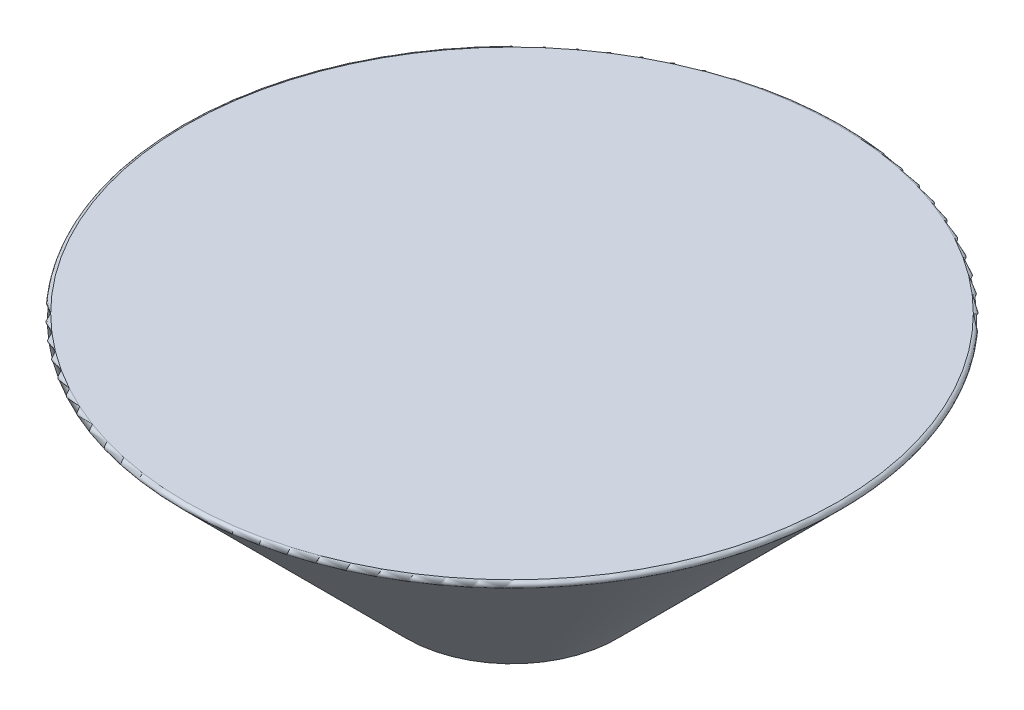
ISO-10303-21;
HEADER;
FILE_DESCRIPTION(('STEP AP214'),'2;1');
FILE_NAME('part.step','',(''),(''),'','','');
FILE_SCHEMA(('AUTOMOTIVE_DESIGN { 1 0 10303 214 1 1 1 1 }'));
ENDSEC;
DATA;
#1=APPLICATION_CONTEXT('core data for automotive mechanical design processes');
#2=APPLICATION_PROTOCOL_DEFINITION('international standard','automotive_design',2000,#1);
#3=PRODUCT_CONTEXT('',#1,'mechanical');
#4=PRODUCT('Part','Part','',(#3));
#5=PRODUCT_RELATED_PRODUCT_CATEGORY('part','',(#4));
#6=PRODUCT_DEFINITION_FORMATION('','',#4);
#7=PRODUCT_DEFINITION_CONTEXT('part definition',#1,'design');
#8=PRODUCT_DEFINITION('design','',#6,#7);
#9=PRODUCT_DEFINITION_SHAPE('','',#8);
#10=(LENGTH_UNIT() NAMED_UNIT(*) SI_UNIT(.MILLI.,.METRE.));
#11=(NAMED_UNIT(*) PLANE_ANGLE_UNIT() SI_UNIT($,.RADIAN.));
#12=(NAMED_UNIT(*) SI_UNIT($,.STERADIAN.) SOLID_ANGLE_UNIT());
#13=UNCERTAINTY_MEASURE_WITH_UNIT(LENGTH_MEASURE(1.E-05),#10,'distance_accuracy_value','');
#14=(GEOMETRIC_REPRESENTATION_CONTEXT(3) GLOBAL_UNCERTAINTY_ASSIGNED_CONTEXT((#13)) GLOBAL_UNIT_ASSIGNED_CONTEXT((#10,
#11,#12)) REPRESENTATION_CONTEXT('',''));
#15=CARTESIAN_POINT('',(0.,0.,0.));
#16=DIRECTION('',(0.,0.,1.));
#17=DIRECTION('',(1.,0.,0.));
#18=AXIS2_PLACEMENT_3D('',#15,#16,#17);
#19=CARTESIAN_POINT('',(0.,0.,0.));
#20=DIRECTION('',(0.,-1.,0.));
#21=DIRECTION('',(0.,0.,-1.));
#22=AXIS2_PLACEMENT_3D('',#19,#20,#21);
#23=PLANE('',#22);
#24=CARTESIAN_POINT('',(0.,0.,0.));
#25=DIRECTION('',(0.,-1.,0.));
#26=DIRECTION('',(0.,0.,-1.));
#27=AXIS2_PLACEMENT_3D('',#24,#25,#26);
#28=CIRCLE('',#27,48.7928932188135);
#29=CARTESIAN_POINT('',(0.,0.,-48.7928932188135));
#30=VERTEX_POINT('',#29);
#31=EDGE_CURVE('E40',#30,#30,#28,.F.);
#32=ORIENTED_EDGE('',*,*,#31,.T.);
#33=EDGE_LOOP('',(#32));
#34=FACE_BOUND('',#33,.T.);
#35=ADVANCED_FACE('F33',(#34),#23,.F.);
#36=CARTESIAN_POINT('',(0.,-13.9139924474052,0.));
#37=DIRECTION('',(0.,1.,0.));
#38=DIRECTION('',(-1.,0.,0.));
#39=AXIS2_PLACEMENT_3D('',#36,#37,#38);
#40=SPHERICAL_SURFACE('',#39,25.7260075525948);
#41=CARTESIAN_POINT('',(0.,-34.2729726973755,0.));
#42=DIRECTION('',(0.,1.,0.));
#43=DIRECTION('',(0.,0.,1.));
#44=AXIS2_PLACEMENT_3D('',#41,#42,#43);
#45=CIRCLE('',#44,15.7270273026242);
#46=CARTESIAN_POINT('',(0.,-34.2729726973755,15.7270273026242));
#47=VERTEX_POINT('',#46);
#48=EDGE_CURVE('E44',#47,#47,#45,.T.);
#49=ORIENTED_EDGE('',*,*,#48,.F.);
#50=EDGE_LOOP('',(#49));
#51=FACE_BOUND('',#50,.T.);
#52=ADVANCED_FACE('F53',(#51),#40,.T.);
#53=CARTESIAN_POINT('',(0.,-34.2729726973755,0.));
#54=DIRECTION('',(0.,1.,0.));
#55=DIRECTION('',(0.,0.,1.));
#56=AXIS2_PLACEMENT_3D('',#53,#54,#55);
#57=CONICAL_SURFACE('',#56,15.7270273026242,0.785398163397454);
#58=CARTESIAN_POINT('',(0.,-0.853553390593273,0.));
#59=DIRECTION('',(0.,-1.,0.));
#60=DIRECTION('',(0.,0.,-1.));
#61=AXIS2_PLACEMENT_3D('',#58,#59,#60);
#62=CIRCLE('',#61,49.1464466094067);
#63=CARTESIAN_POINT('',(0.,-0.853553390593273,-49.1464466094067));
#64=VERTEX_POINT('',#63);
#65=EDGE_CURVE('E10',#64,#64,#62,.T.);
#66=ORIENTED_EDGE('',*,*,#65,.T.);
#67=EDGE_LOOP('',(#66));
#68=FACE_BOUND('',#67,.T.);
#69=ORIENTED_EDGE('',*,*,#48,.T.);
#70=EDGE_LOOP('',(#69));
#71=FACE_BOUND('',#70,.T.);
#72=ADVANCED_FACE('F51',(#68,#71),#57,.T.);
#73=CARTESIAN_POINT('',(0.,-0.5,0.));
#74=DIRECTION('',(0.,-1.,0.));
#75=DIRECTION('',(0.,0.,-1.));
#76=AXIS2_PLACEMENT_3D('',#73,#74,#75);
#77=TOROIDAL_SURFACE('',#76,48.7928932188135,0.5);
#78=ORIENTED_EDGE('',*,*,#65,.F.);
#79=EDGE_LOOP('',(#78));
#80=FACE_BOUND('',#79,.T.);
#81=ORIENTED_EDGE('',*,*,#31,.F.);
#82=EDGE_LOOP('',(#81));
#83=FACE_BOUND('',#82,.T.);
#84=ADVANCED_FACE('F35',(#80,#83),#77,.T.);
#85=CLOSED_SHELL('',(#35,#52,#72,#84));
#86=MANIFOLD_SOLID_BREP('B2',#85);
#87=ADVANCED_BREP_SHAPE_REPRESENTATION('',(#18,#86),#14);
#88=SHAPE_DEFINITION_REPRESENTATION(#9,#87);
ENDSEC;
END-ISO-10303-21;
